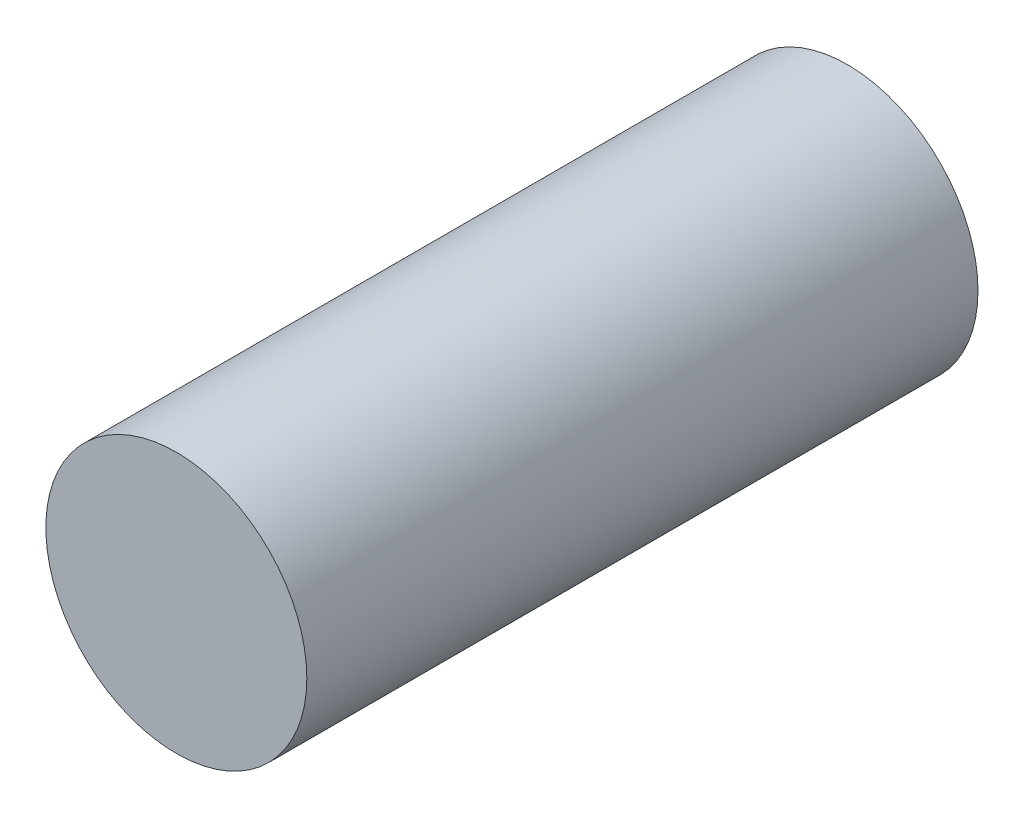
ISO-10303-21;
HEADER;
FILE_DESCRIPTION(('STEP AP214'),'2;1');
FILE_NAME('part.step','',(''),(''),'','','');
FILE_SCHEMA(('AUTOMOTIVE_DESIGN { 1 0 10303 214 1 1 1 1 }'));
ENDSEC;
DATA;
#1=APPLICATION_CONTEXT('core data for automotive mechanical design processes');
#2=APPLICATION_PROTOCOL_DEFINITION('international standard','automotive_design',2000,#1);
#3=PRODUCT_CONTEXT('',#1,'mechanical');
#4=PRODUCT('Part','Part','',(#3));
#5=PRODUCT_RELATED_PRODUCT_CATEGORY('part','',(#4));
#6=PRODUCT_DEFINITION_FORMATION('','',#4);
#7=PRODUCT_DEFINITION_CONTEXT('part definition',#1,'design');
#8=PRODUCT_DEFINITION('design','',#6,#7);
#9=PRODUCT_DEFINITION_SHAPE('','',#8);
#10=(LENGTH_UNIT() NAMED_UNIT(*) SI_UNIT(.MILLI.,.METRE.));
#11=(NAMED_UNIT(*) PLANE_ANGLE_UNIT() SI_UNIT($,.RADIAN.));
#12=(NAMED_UNIT(*) SI_UNIT($,.STERADIAN.) SOLID_ANGLE_UNIT());
#13=UNCERTAINTY_MEASURE_WITH_UNIT(LENGTH_MEASURE(1.E-05),#10,'distance_accuracy_value','');
#14=(GEOMETRIC_REPRESENTATION_CONTEXT(3) GLOBAL_UNCERTAINTY_ASSIGNED_CONTEXT((#13)) GLOBAL_UNIT_ASSIGNED_CONTEXT((#10,
#11,#12)) REPRESENTATION_CONTEXT('',''));
#15=CARTESIAN_POINT('',(0.,0.,0.));
#16=DIRECTION('',(0.,0.,1.));
#17=DIRECTION('',(1.,0.,0.));
#18=AXIS2_PLACEMENT_3D('',#15,#16,#17);
#19=CARTESIAN_POINT('',(0.,0.,20.574));
#20=DIRECTION('',(0.,0.,-1.));
#21=DIRECTION('',(-1.,0.,0.));
#22=AXIS2_PLACEMENT_3D('',#19,#20,#21);
#23=CYLINDRICAL_SURFACE('',#22,4.);
#24=CARTESIAN_POINT('',(0.,0.,20.574));
#25=DIRECTION('',(0.,0.,1.));
#26=DIRECTION('',(1.,0.,0.));
#27=AXIS2_PLACEMENT_3D('',#24,#25,#26);
#28=CIRCLE('',#27,4.);
#29=CARTESIAN_POINT('',(4.,0.,20.574));
#30=VERTEX_POINT('',#29);
#31=EDGE_CURVE('E10',#30,#30,#28,.T.);
#32=ORIENTED_EDGE('',*,*,#31,.F.);
#33=EDGE_LOOP('',(#32));
#34=FACE_BOUND('',#33,.T.);
#35=CARTESIAN_POINT('',(0.,0.,0.));
#36=DIRECTION('',(0.,0.,1.));
#37=DIRECTION('',(1.,0.,0.));
#38=AXIS2_PLACEMENT_3D('',#35,#36,#37);
#39=CIRCLE('',#38,4.);
#40=CARTESIAN_POINT('',(4.,0.,0.));
#41=VERTEX_POINT('',#40);
#42=EDGE_CURVE('E35',#41,#41,#39,.T.);
#43=ORIENTED_EDGE('',*,*,#42,.T.);
#44=EDGE_LOOP('',(#43));
#45=FACE_BOUND('',#44,.T.);
#46=ADVANCED_FACE('F32',(#34,#45),#23,.T.);
#47=CARTESIAN_POINT('',(0.,0.,20.574));
#48=DIRECTION('',(0.,0.,1.));
#49=DIRECTION('',(1.,0.,0.));
#50=AXIS2_PLACEMENT_3D('',#47,#48,#49);
#51=PLANE('',#50);
#52=ORIENTED_EDGE('',*,*,#31,.T.);
#53=EDGE_LOOP('',(#52));
#54=FACE_BOUND('',#53,.T.);
#55=ADVANCED_FACE('F47',(#54),#51,.T.);
#56=CARTESIAN_POINT('',(0.,0.,0.));
#57=DIRECTION('',(0.,0.,1.));
#58=DIRECTION('',(1.,0.,0.));
#59=AXIS2_PLACEMENT_3D('',#56,#57,#58);
#60=PLANE('',#59);
#61=ORIENTED_EDGE('',*,*,#42,.F.);
#62=EDGE_LOOP('',(#61));
#63=FACE_BOUND('',#62,.T.);
#64=ADVANCED_FACE('F45',(#63),#60,.F.);
#65=CLOSED_SHELL('',(#46,#55,#64));
#66=MANIFOLD_SOLID_BREP('B2',#65);
#67=ADVANCED_BREP_SHAPE_REPRESENTATION('',(#18,#66),#14);
#68=SHAPE_DEFINITION_REPRESENTATION(#9,#67);
ENDSEC;
END-ISO-10303-21;
